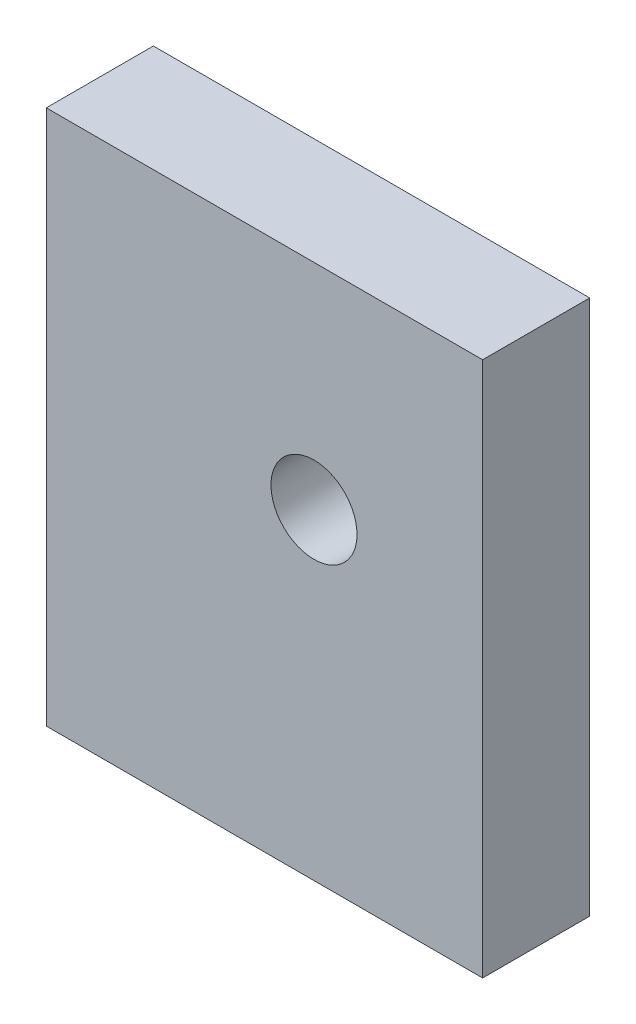
ISO-10303-21;
HEADER;
FILE_DESCRIPTION(('STEP AP214'),'2;1');
FILE_NAME('part.step','',(''),(''),'','','');
FILE_SCHEMA(('AUTOMOTIVE_DESIGN { 1 0 10303 214 1 1 1 1 }'));
ENDSEC;
DATA;
#1=APPLICATION_CONTEXT('core data for automotive mechanical design processes');
#2=APPLICATION_PROTOCOL_DEFINITION('international standard','automotive_design',2000,#1);
#3=PRODUCT_CONTEXT('',#1,'mechanical');
#4=PRODUCT('Part','Part','',(#3));
#5=PRODUCT_RELATED_PRODUCT_CATEGORY('part','',(#4));
#6=PRODUCT_DEFINITION_FORMATION('','',#4);
#7=PRODUCT_DEFINITION_CONTEXT('part definition',#1,'design');
#8=PRODUCT_DEFINITION('design','',#6,#7);
#9=PRODUCT_DEFINITION_SHAPE('','',#8);
#10=(LENGTH_UNIT() NAMED_UNIT(*) SI_UNIT(.MILLI.,.METRE.));
#11=(NAMED_UNIT(*) PLANE_ANGLE_UNIT() SI_UNIT($,.RADIAN.));
#12=(NAMED_UNIT(*) SI_UNIT($,.STERADIAN.) SOLID_ANGLE_UNIT());
#13=UNCERTAINTY_MEASURE_WITH_UNIT(LENGTH_MEASURE(1.E-05),#10,'distance_accuracy_value','');
#14=(GEOMETRIC_REPRESENTATION_CONTEXT(3) GLOBAL_UNCERTAINTY_ASSIGNED_CONTEXT((#13)) GLOBAL_UNIT_ASSIGNED_CONTEXT((#10,
#11,#12)) REPRESENTATION_CONTEXT('',''));
#15=CARTESIAN_POINT('',(0.,0.,0.));
#16=DIRECTION('',(0.,0.,1.));
#17=DIRECTION('',(1.,0.,0.));
#18=AXIS2_PLACEMENT_3D('',#15,#16,#17);
#19=CARTESIAN_POINT('',(-48.4788076171661,51.0758865966571,6.35));
#20=DIRECTION('',(1.,0.,0.));
#21=DIRECTION('',(0.,0.,-1.));
#22=AXIS2_PLACEMENT_3D('',#19,#20,#21);
#23=PLANE('',#22);
#24=DIRECTION('',(0.,-1.,0.));
#25=VECTOR('',#24,1.);
#26=CARTESIAN_POINT('',(-48.4788076171661,51.0758865966571,0.));
#27=LINE('',#26,#25);
#28=CARTESIAN_POINT('',(-48.4788076171661,51.0758865966571,0.));
#29=VERTEX_POINT('',#28);
#30=CARTESIAN_POINT('',(-48.4788076171661,19.3258865966571,0.));
#31=VERTEX_POINT('',#30);
#32=EDGE_CURVE('E108',#29,#31,#27,.T.);
#33=ORIENTED_EDGE('',*,*,#32,.T.);
#34=DIRECTION('',(0.,0.,-1.));
#35=VECTOR('',#34,1.);
#36=CARTESIAN_POINT('',(-48.4788076171661,19.3258865966571,6.35));
#37=LINE('',#36,#35);
#38=CARTESIAN_POINT('',(-48.4788076171661,19.3258865966571,6.35));
#39=VERTEX_POINT('',#38);
#40=EDGE_CURVE('E12',#39,#31,#37,.T.);
#41=ORIENTED_EDGE('',*,*,#40,.F.);
#42=DIRECTION('',(0.,-1.,0.));
#43=VECTOR('',#42,1.);
#44=CARTESIAN_POINT('',(-48.4788076171661,51.0758865966571,6.35));
#45=LINE('',#44,#43);
#46=CARTESIAN_POINT('',(-48.4788076171661,51.0758865966571,6.35));
#47=VERTEX_POINT('',#46);
#48=EDGE_CURVE('E90',#47,#39,#45,.T.);
#49=ORIENTED_EDGE('',*,*,#48,.F.);
#50=DIRECTION('',(0.,0.,-1.));
#51=VECTOR('',#50,1.);
#52=CARTESIAN_POINT('',(-48.4788076171661,51.0758865966571,6.35));
#53=LINE('',#52,#51);
#54=EDGE_CURVE('E57',#47,#29,#53,.T.);
#55=ORIENTED_EDGE('',*,*,#54,.T.);
#56=EDGE_LOOP('',(#33,#41,#49,#55));
#57=FACE_BOUND('',#56,.T.);
#58=ADVANCED_FACE('F40',(#57),#23,.F.);
#59=CARTESIAN_POINT('',(-48.4788076171661,19.3258865966571,6.35));
#60=DIRECTION('',(0.,1.,0.));
#61=DIRECTION('',(0.,0.,1.));
#62=AXIS2_PLACEMENT_3D('',#59,#60,#61);
#63=PLANE('',#62);
#64=DIRECTION('',(1.,0.,0.));
#65=VECTOR('',#64,1.);
#66=CARTESIAN_POINT('',(-48.4788076171661,19.3258865966571,0.));
#67=LINE('',#66,#65);
#68=CARTESIAN_POINT('',(-22.6038076171661,19.3258865966571,0.));
#69=VERTEX_POINT('',#68);
#70=EDGE_CURVE('E96',#31,#69,#67,.T.);
#71=ORIENTED_EDGE('',*,*,#70,.T.);
#72=DIRECTION('',(0.,0.,-1.));
#73=VECTOR('',#72,1.);
#74=CARTESIAN_POINT('',(-22.6038076171661,19.3258865966571,6.35));
#75=LINE('',#74,#73);
#76=CARTESIAN_POINT('',(-22.6038076171661,19.3258865966571,6.35));
#77=VERTEX_POINT('',#76);
#78=EDGE_CURVE('E49',#77,#69,#75,.T.);
#79=ORIENTED_EDGE('',*,*,#78,.F.);
#80=DIRECTION('',(1.,0.,0.));
#81=VECTOR('',#80,1.);
#82=CARTESIAN_POINT('',(-48.4788076171661,19.3258865966571,6.35));
#83=LINE('',#82,#81);
#84=EDGE_CURVE('E82',#39,#77,#83,.T.);
#85=ORIENTED_EDGE('',*,*,#84,.F.);
#86=ORIENTED_EDGE('',*,*,#40,.T.);
#87=EDGE_LOOP('',(#71,#79,#85,#86));
#88=FACE_BOUND('',#87,.T.);
#89=ADVANCED_FACE('F95',(#88),#63,.F.);
#90=CARTESIAN_POINT('',(-22.6038076171661,51.0758865966571,6.35));
#91=DIRECTION('',(1.,0.,0.));
#92=DIRECTION('',(0.,1.,0.));
#93=AXIS2_PLACEMENT_3D('',#90,#91,#92);
#94=PLANE('',#93);
#95=DIRECTION('',(0.,-1.,0.));
#96=VECTOR('',#95,1.);
#97=CARTESIAN_POINT('',(-22.6038076171661,51.0758865966571,0.));
#98=LINE('',#97,#96);
#99=CARTESIAN_POINT('',(-22.6038076171661,51.0758865966571,0.));
#100=VERTEX_POINT('',#99);
#101=EDGE_CURVE('E114',#100,#69,#98,.T.);
#102=ORIENTED_EDGE('',*,*,#101,.F.);
#103=DIRECTION('',(0.,0.,-1.));
#104=VECTOR('',#103,1.);
#105=CARTESIAN_POINT('',(-22.6038076171661,51.0758865966571,6.35));
#106=LINE('',#105,#104);
#107=CARTESIAN_POINT('',(-22.6038076171661,51.0758865966571,6.35));
#108=VERTEX_POINT('',#107);
#109=EDGE_CURVE('E71',#108,#100,#106,.T.);
#110=ORIENTED_EDGE('',*,*,#109,.F.);
#111=DIRECTION('',(0.,-1.,0.));
#112=VECTOR('',#111,1.);
#113=CARTESIAN_POINT('',(-22.6038076171661,51.0758865966571,6.35));
#114=LINE('',#113,#112);
#115=EDGE_CURVE('E89',#108,#77,#114,.T.);
#116=ORIENTED_EDGE('',*,*,#115,.T.);
#117=ORIENTED_EDGE('',*,*,#78,.T.);
#118=EDGE_LOOP('',(#102,#110,#116,#117));
#119=FACE_BOUND('',#118,.T.);
#120=ADVANCED_FACE('F100',(#119),#94,.T.);
#121=CARTESIAN_POINT('',(-48.4788076171661,51.0758865966571,6.35));
#122=DIRECTION('',(0.,1.,0.));
#123=DIRECTION('',(0.,0.,1.));
#124=AXIS2_PLACEMENT_3D('',#121,#122,#123);
#125=PLANE('',#124);
#126=DIRECTION('',(1.,0.,0.));
#127=VECTOR('',#126,1.);
#128=CARTESIAN_POINT('',(-48.4788076171661,51.0758865966571,0.));
#129=LINE('',#128,#127);
#130=EDGE_CURVE('E117',#29,#100,#129,.T.);
#131=ORIENTED_EDGE('',*,*,#130,.F.);
#132=ORIENTED_EDGE('',*,*,#54,.F.);
#133=DIRECTION('',(1.,0.,0.));
#134=VECTOR('',#133,1.);
#135=CARTESIAN_POINT('',(-48.4788076171661,51.0758865966571,6.35));
#136=LINE('',#135,#134);
#137=EDGE_CURVE('E102',#47,#108,#136,.T.);
#138=ORIENTED_EDGE('',*,*,#137,.T.);
#139=ORIENTED_EDGE('',*,*,#109,.T.);
#140=EDGE_LOOP('',(#131,#132,#138,#139));
#141=FACE_BOUND('',#140,.T.);
#142=ADVANCED_FACE('F140',(#141),#125,.T.);
#143=CARTESIAN_POINT('',(0.,0.,6.35));
#144=DIRECTION('',(0.,0.,1.));
#145=DIRECTION('',(1.,0.,0.));
#146=AXIS2_PLACEMENT_3D('',#143,#144,#145);
#147=PLANE('',#146);
#148=CARTESIAN_POINT('',(-32.6038076171661,38.3758865966571,6.35));
#149=DIRECTION('',(0.,0.,1.));
#150=DIRECTION('',(1.,0.,0.));
#151=AXIS2_PLACEMENT_3D('',#148,#149,#150);
#152=CIRCLE('',#151,2.55101190848647);
#153=CARTESIAN_POINT('',(-30.0527957086797,38.3758865966571,6.35));
#154=VERTEX_POINT('',#153);
#155=EDGE_CURVE('E111',#154,#154,#152,.T.);
#156=ORIENTED_EDGE('',*,*,#155,.F.);
#157=EDGE_LOOP('',(#156));
#158=FACE_BOUND('',#157,.T.);
#159=ORIENTED_EDGE('',*,*,#48,.T.);
#160=ORIENTED_EDGE('',*,*,#84,.T.);
#161=ORIENTED_EDGE('',*,*,#115,.F.);
#162=ORIENTED_EDGE('',*,*,#137,.F.);
#163=EDGE_LOOP('',(#159,#160,#161,#162));
#164=FACE_BOUND('',#163,.T.);
#165=ADVANCED_FACE('F86',(#158,#164),#147,.T.);
#166=CARTESIAN_POINT('',(0.,0.,0.));
#167=DIRECTION('',(0.,0.,1.));
#168=DIRECTION('',(1.,0.,0.));
#169=AXIS2_PLACEMENT_3D('',#166,#167,#168);
#170=PLANE('',#169);
#171=CARTESIAN_POINT('',(-32.6038076171661,38.3758865966571,0.));
#172=DIRECTION('',(0.,0.,1.));
#173=DIRECTION('',(1.,0.,0.));
#174=AXIS2_PLACEMENT_3D('',#171,#172,#173);
#175=CIRCLE('',#174,2.55101190848647);
#176=CARTESIAN_POINT('',(-30.0527957086797,38.3758865966571,0.));
#177=VERTEX_POINT('',#176);
#178=EDGE_CURVE('E127',#177,#177,#175,.T.);
#179=ORIENTED_EDGE('',*,*,#178,.T.);
#180=EDGE_LOOP('',(#179));
#181=FACE_BOUND('',#180,.T.);
#182=ORIENTED_EDGE('',*,*,#32,.F.);
#183=ORIENTED_EDGE('',*,*,#130,.T.);
#184=ORIENTED_EDGE('',*,*,#101,.T.);
#185=ORIENTED_EDGE('',*,*,#70,.F.);
#186=EDGE_LOOP('',(#182,#183,#184,#185));
#187=FACE_BOUND('',#186,.T.);
#188=ADVANCED_FACE('F139',(#181,#187),#170,.F.);
#189=CARTESIAN_POINT('',(-32.6038076171661,38.3758865966571,6.35));
#190=DIRECTION('',(0.,0.,-1.));
#191=DIRECTION('',(-1.,0.,0.));
#192=AXIS2_PLACEMENT_3D('',#189,#190,#191);
#193=CYLINDRICAL_SURFACE('',#192,2.55101190848647);
#194=ORIENTED_EDGE('',*,*,#155,.T.);
#195=EDGE_LOOP('',(#194));
#196=FACE_BOUND('',#195,.T.);
#197=ORIENTED_EDGE('',*,*,#178,.F.);
#198=EDGE_LOOP('',(#197));
#199=FACE_BOUND('',#198,.T.);
#200=ADVANCED_FACE('F135',(#196,#199),#193,.F.);
#201=CLOSED_SHELL('',(#58,#89,#120,#142,#165,#188,#200));
#202=MANIFOLD_SOLID_BREP('B2',#201);
#203=ADVANCED_BREP_SHAPE_REPRESENTATION('',(#18,#202),#14);
#204=SHAPE_DEFINITION_REPRESENTATION(#9,#203);
ENDSEC;
END-ISO-10303-21;
